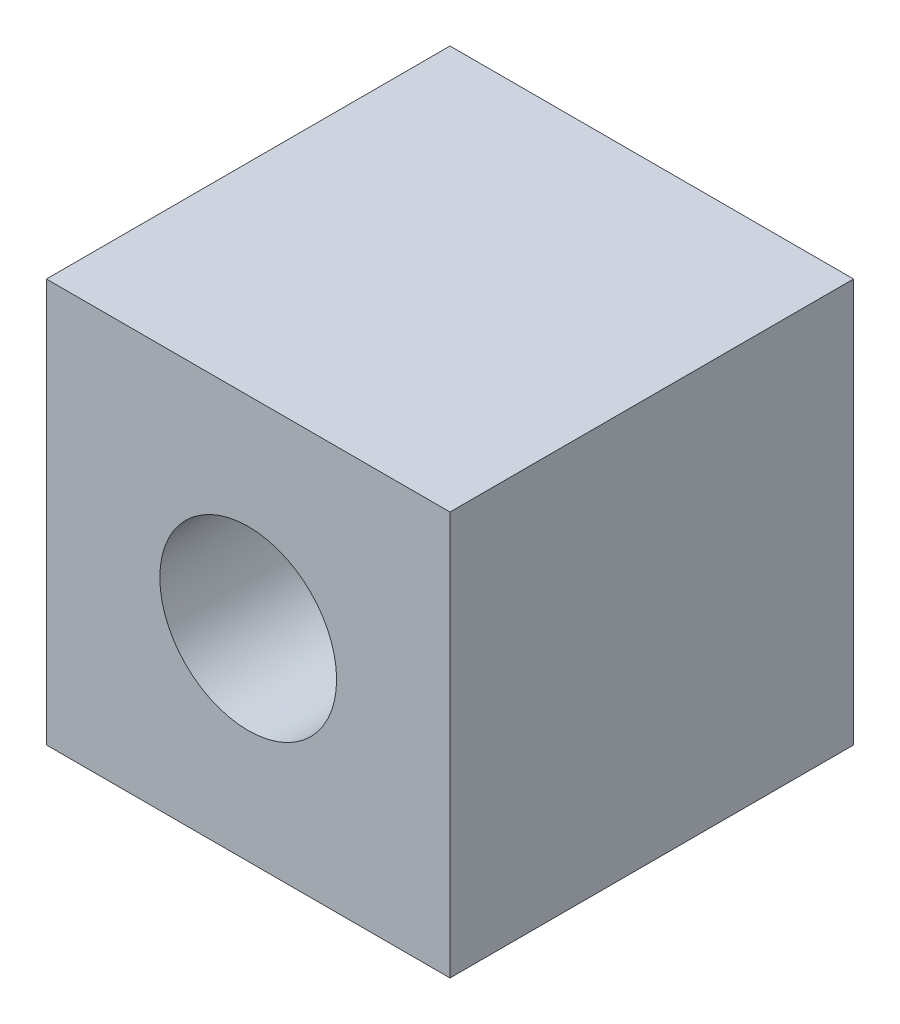
ISO-10303-21;
HEADER;
FILE_DESCRIPTION(('STEP AP214'),'2;1');
FILE_NAME('part.step','',(''),(''),'','','');
FILE_SCHEMA(('AUTOMOTIVE_DESIGN { 1 0 10303 214 1 1 1 1 }'));
ENDSEC;
DATA;
#1=APPLICATION_CONTEXT('core data for automotive mechanical design processes');
#2=APPLICATION_PROTOCOL_DEFINITION('international standard','automotive_design',2000,#1);
#3=PRODUCT_CONTEXT('',#1,'mechanical');
#4=PRODUCT('Part','Part','',(#3));
#5=PRODUCT_RELATED_PRODUCT_CATEGORY('part','',(#4));
#6=PRODUCT_DEFINITION_FORMATION('','',#4);
#7=PRODUCT_DEFINITION_CONTEXT('part definition',#1,'design');
#8=PRODUCT_DEFINITION('design','',#6,#7);
#9=PRODUCT_DEFINITION_SHAPE('','',#8);
#10=(LENGTH_UNIT() NAMED_UNIT(*) SI_UNIT(.MILLI.,.METRE.));
#11=(NAMED_UNIT(*) PLANE_ANGLE_UNIT() SI_UNIT($,.RADIAN.));
#12=(NAMED_UNIT(*) SI_UNIT($,.STERADIAN.) SOLID_ANGLE_UNIT());
#13=UNCERTAINTY_MEASURE_WITH_UNIT(LENGTH_MEASURE(1.E-05),#10,'distance_accuracy_value','');
#14=(GEOMETRIC_REPRESENTATION_CONTEXT(3) GLOBAL_UNCERTAINTY_ASSIGNED_CONTEXT((#13)) GLOBAL_UNIT_ASSIGNED_CONTEXT((#10,
#11,#12)) REPRESENTATION_CONTEXT('',''));
#15=CARTESIAN_POINT('',(0.,0.,0.));
#16=DIRECTION('',(0.,0.,1.));
#17=DIRECTION('',(1.,0.,0.));
#18=AXIS2_PLACEMENT_3D('',#15,#16,#17);
#19=CARTESIAN_POINT('',(-12.7,25.4,12.7));
#20=DIRECTION('',(-1.,0.,0.));
#21=DIRECTION('',(0.,0.,1.));
#22=AXIS2_PLACEMENT_3D('',#19,#20,#21);
#23=PLANE('',#22);
#24=DIRECTION('',(0.,0.,-1.));
#25=VECTOR('',#24,1.);
#26=CARTESIAN_POINT('',(-12.7,0.,12.7));
#27=LINE('',#26,#25);
#28=CARTESIAN_POINT('',(-12.7,0.,12.7));
#29=VERTEX_POINT('',#28);
#30=CARTESIAN_POINT('',(-12.7,0.,-12.7));
#31=VERTEX_POINT('',#30);
#32=EDGE_CURVE('E101',#29,#31,#27,.T.);
#33=ORIENTED_EDGE('',*,*,#32,.F.);
#34=DIRECTION('',(0.,-1.,0.));
#35=VECTOR('',#34,1.);
#36=CARTESIAN_POINT('',(-12.7,25.4,12.7));
#37=LINE('',#36,#35);
#38=CARTESIAN_POINT('',(-12.7,25.4,12.7));
#39=VERTEX_POINT('',#38);
#40=EDGE_CURVE('E11',#39,#29,#37,.T.);
#41=ORIENTED_EDGE('',*,*,#40,.F.);
#42=DIRECTION('',(0.,0.,-1.));
#43=VECTOR('',#42,1.);
#44=CARTESIAN_POINT('',(-12.7,25.4,12.7));
#45=LINE('',#44,#43);
#46=CARTESIAN_POINT('',(-12.7,25.4,-12.7));
#47=VERTEX_POINT('',#46);
#48=EDGE_CURVE('E95',#39,#47,#45,.T.);
#49=ORIENTED_EDGE('',*,*,#48,.T.);
#50=DIRECTION('',(0.,-1.,0.));
#51=VECTOR('',#50,1.);
#52=CARTESIAN_POINT('',(-12.7,25.4,-12.7));
#53=LINE('',#52,#51);
#54=EDGE_CURVE('E74',#47,#31,#53,.T.);
#55=ORIENTED_EDGE('',*,*,#54,.T.);
#56=EDGE_LOOP('',(#33,#41,#49,#55));
#57=FACE_BOUND('',#56,.T.);
#58=ADVANCED_FACE('F33',(#57),#23,.T.);
#59=CARTESIAN_POINT('',(-12.7,25.4,12.7));
#60=DIRECTION('',(0.,0.,-1.));
#61=DIRECTION('',(-1.,0.,0.));
#62=AXIS2_PLACEMENT_3D('',#59,#60,#61);
#63=PLANE('',#62);
#64=CARTESIAN_POINT('',(0.,12.7,12.7));
#65=DIRECTION('',(0.,0.,1.));
#66=DIRECTION('',(1.,0.,0.));
#67=AXIS2_PLACEMENT_3D('',#64,#65,#66);
#68=CIRCLE('',#67,5.5626);
#69=CARTESIAN_POINT('',(5.5626,12.7,12.7));
#70=VERTEX_POINT('',#69);
#71=EDGE_CURVE('E138',#70,#70,#68,.T.);
#72=ORIENTED_EDGE('',*,*,#71,.F.);
#73=EDGE_LOOP('',(#72));
#74=FACE_BOUND('',#73,.T.);
#75=DIRECTION('',(1.,0.,0.));
#76=VECTOR('',#75,1.);
#77=CARTESIAN_POINT('',(-12.7,0.,12.7));
#78=LINE('',#77,#76);
#79=CARTESIAN_POINT('',(12.7,0.,12.7));
#80=VERTEX_POINT('',#79);
#81=EDGE_CURVE('E66',#29,#80,#78,.T.);
#82=ORIENTED_EDGE('',*,*,#81,.T.);
#83=DIRECTION('',(0.,-1.,0.));
#84=VECTOR('',#83,1.);
#85=CARTESIAN_POINT('',(12.7,25.4,12.7));
#86=LINE('',#85,#84);
#87=CARTESIAN_POINT('',(12.7,25.4,12.7));
#88=VERTEX_POINT('',#87);
#89=EDGE_CURVE('E42',#88,#80,#86,.T.);
#90=ORIENTED_EDGE('',*,*,#89,.F.);
#91=DIRECTION('',(1.,0.,0.));
#92=VECTOR('',#91,1.);
#93=CARTESIAN_POINT('',(-12.7,25.4,12.7));
#94=LINE('',#93,#92);
#95=EDGE_CURVE('E84',#39,#88,#94,.T.);
#96=ORIENTED_EDGE('',*,*,#95,.F.);
#97=ORIENTED_EDGE('',*,*,#40,.T.);
#98=EDGE_LOOP('',(#82,#90,#96,#97));
#99=FACE_BOUND('',#98,.T.);
#100=ADVANCED_FACE('F122',(#74,#99),#63,.F.);
#101=CARTESIAN_POINT('',(12.7,25.4,12.7));
#102=DIRECTION('',(-1.,0.,0.));
#103=DIRECTION('',(0.,0.,1.));
#104=AXIS2_PLACEMENT_3D('',#101,#102,#103);
#105=PLANE('',#104);
#106=DIRECTION('',(0.,0.,-1.));
#107=VECTOR('',#106,1.);
#108=CARTESIAN_POINT('',(12.7,0.,12.7));
#109=LINE('',#108,#107);
#110=CARTESIAN_POINT('',(12.7,0.,-12.7));
#111=VERTEX_POINT('',#110);
#112=EDGE_CURVE('E91',#80,#111,#109,.T.);
#113=ORIENTED_EDGE('',*,*,#112,.T.);
#114=DIRECTION('',(0.,-1.,0.));
#115=VECTOR('',#114,1.);
#116=CARTESIAN_POINT('',(12.7,25.4,-12.7));
#117=LINE('',#116,#115);
#118=CARTESIAN_POINT('',(12.7,25.4,-12.7));
#119=VERTEX_POINT('',#118);
#120=EDGE_CURVE('E88',#119,#111,#117,.T.);
#121=ORIENTED_EDGE('',*,*,#120,.F.);
#122=DIRECTION('',(0.,0.,-1.));
#123=VECTOR('',#122,1.);
#124=CARTESIAN_POINT('',(12.7,25.4,12.7));
#125=LINE('',#124,#123);
#126=EDGE_CURVE('E79',#88,#119,#125,.T.);
#127=ORIENTED_EDGE('',*,*,#126,.F.);
#128=ORIENTED_EDGE('',*,*,#89,.T.);
#129=EDGE_LOOP('',(#113,#121,#127,#128));
#130=FACE_BOUND('',#129,.T.);
#131=ADVANCED_FACE('F89',(#130),#105,.F.);
#132=CARTESIAN_POINT('',(-12.7,25.4,-12.7));
#133=DIRECTION('',(0.,0.,-1.));
#134=DIRECTION('',(-1.,0.,0.));
#135=AXIS2_PLACEMENT_3D('',#132,#133,#134);
#136=PLANE('',#135);
#137=CARTESIAN_POINT('',(0.,12.7,-12.7));
#138=DIRECTION('',(0.,0.,-1.));
#139=DIRECTION('',(-1.,0.,0.));
#140=AXIS2_PLACEMENT_3D('',#137,#138,#139);
#141=CIRCLE('',#140,5.5626);
#142=CARTESIAN_POINT('',(-5.5626,12.7,-12.7));
#143=VERTEX_POINT('',#142);
#144=EDGE_CURVE('E36',#143,#143,#141,.T.);
#145=ORIENTED_EDGE('',*,*,#144,.F.);
#146=EDGE_LOOP('',(#145));
#147=FACE_BOUND('',#146,.T.);
#148=DIRECTION('',(1.,0.,0.));
#149=VECTOR('',#148,1.);
#150=CARTESIAN_POINT('',(-12.7,0.,-12.7));
#151=LINE('',#150,#149);
#152=EDGE_CURVE('E104',#31,#111,#151,.T.);
#153=ORIENTED_EDGE('',*,*,#152,.F.);
#154=ORIENTED_EDGE('',*,*,#54,.F.);
#155=DIRECTION('',(1.,0.,0.));
#156=VECTOR('',#155,1.);
#157=CARTESIAN_POINT('',(-12.7,25.4,-12.7));
#158=LINE('',#157,#156);
#159=EDGE_CURVE('E83',#47,#119,#158,.T.);
#160=ORIENTED_EDGE('',*,*,#159,.T.);
#161=ORIENTED_EDGE('',*,*,#120,.T.);
#162=EDGE_LOOP('',(#153,#154,#160,#161));
#163=FACE_BOUND('',#162,.T.);
#164=ADVANCED_FACE('F94',(#147,#163),#136,.T.);
#165=CARTESIAN_POINT('',(0.,25.4,0.));
#166=DIRECTION('',(0.,-1.,0.));
#167=DIRECTION('',(0.,0.,-1.));
#168=AXIS2_PLACEMENT_3D('',#165,#166,#167);
#169=PLANE('',#168);
#170=ORIENTED_EDGE('',*,*,#48,.F.);
#171=ORIENTED_EDGE('',*,*,#95,.T.);
#172=ORIENTED_EDGE('',*,*,#126,.T.);
#173=ORIENTED_EDGE('',*,*,#159,.F.);
#174=EDGE_LOOP('',(#170,#171,#172,#173));
#175=FACE_BOUND('',#174,.T.);
#176=ADVANCED_FACE('F82',(#175),#169,.F.);
#177=CARTESIAN_POINT('',(0.,0.,0.));
#178=DIRECTION('',(0.,-1.,0.));
#179=DIRECTION('',(0.,0.,-1.));
#180=AXIS2_PLACEMENT_3D('',#177,#178,#179);
#181=PLANE('',#180);
#182=ORIENTED_EDGE('',*,*,#32,.T.);
#183=ORIENTED_EDGE('',*,*,#152,.T.);
#184=ORIENTED_EDGE('',*,*,#112,.F.);
#185=ORIENTED_EDGE('',*,*,#81,.F.);
#186=EDGE_LOOP('',(#182,#183,#184,#185));
#187=FACE_BOUND('',#186,.T.);
#188=ADVANCED_FACE('F109',(#187),#181,.T.);
#189=CARTESIAN_POINT('',(0.,12.7,-63.5));
#190=DIRECTION('',(0.,0.,1.));
#191=DIRECTION('',(1.,0.,0.));
#192=AXIS2_PLACEMENT_3D('',#189,#190,#191);
#193=CYLINDRICAL_SURFACE('',#192,5.5626);
#194=ORIENTED_EDGE('',*,*,#144,.T.);
#195=EDGE_LOOP('',(#194));
#196=FACE_BOUND('',#195,.T.);
#197=ORIENTED_EDGE('',*,*,#71,.T.);
#198=EDGE_LOOP('',(#197));
#199=FACE_BOUND('',#198,.T.);
#200=ADVANCED_FACE('F111',(#196,#199),#193,.F.);
#201=CLOSED_SHELL('',(#58,#100,#131,#164,#176,#188,#200));
#202=MANIFOLD_SOLID_BREP('B2',#201);
#203=ADVANCED_BREP_SHAPE_REPRESENTATION('',(#18,#202),#14);
#204=SHAPE_DEFINITION_REPRESENTATION(#9,#203);
ENDSEC;
END-ISO-10303-21;
